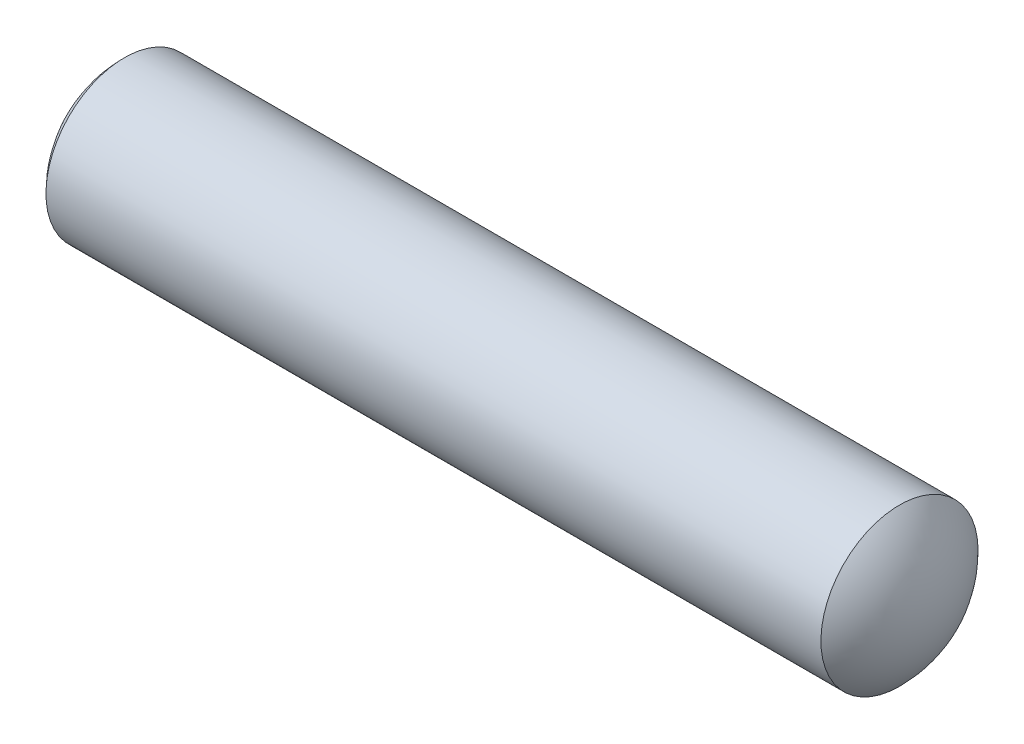
ISO-10303-21;
HEADER;
FILE_DESCRIPTION(('STEP AP214'),'2;1');
FILE_NAME('part.step','',(''),(''),'','','');
FILE_SCHEMA(('AUTOMOTIVE_DESIGN { 1 0 10303 214 1 1 1 1 }'));
ENDSEC;
DATA;
#1=APPLICATION_CONTEXT('core data for automotive mechanical design processes');
#2=APPLICATION_PROTOCOL_DEFINITION('international standard','automotive_design',2000,#1);
#3=PRODUCT_CONTEXT('',#1,'mechanical');
#4=PRODUCT('Part','Part','',(#3));
#5=PRODUCT_RELATED_PRODUCT_CATEGORY('part','',(#4));
#6=PRODUCT_DEFINITION_FORMATION('','',#4);
#7=PRODUCT_DEFINITION_CONTEXT('part definition',#1,'design');
#8=PRODUCT_DEFINITION('design','',#6,#7);
#9=PRODUCT_DEFINITION_SHAPE('','',#8);
#10=(LENGTH_UNIT() NAMED_UNIT(*) SI_UNIT(.MILLI.,.METRE.));
#11=(NAMED_UNIT(*) PLANE_ANGLE_UNIT() SI_UNIT($,.RADIAN.));
#12=(NAMED_UNIT(*) SI_UNIT($,.STERADIAN.) SOLID_ANGLE_UNIT());
#13=UNCERTAINTY_MEASURE_WITH_UNIT(LENGTH_MEASURE(1.E-05),#10,'distance_accuracy_value','');
#14=(GEOMETRIC_REPRESENTATION_CONTEXT(3) GLOBAL_UNCERTAINTY_ASSIGNED_CONTEXT((#13)) GLOBAL_UNIT_ASSIGNED_CONTEXT((#10,
#11,#12)) REPRESENTATION_CONTEXT('',''));
#15=CARTESIAN_POINT('',(0.,0.,0.));
#16=DIRECTION('',(0.,0.,1.));
#17=DIRECTION('',(1.,0.,0.));
#18=AXIS2_PLACEMENT_3D('',#15,#16,#17);
#19=CARTESIAN_POINT('',(15.1875,21.3125,0.));
#20=DIRECTION('',(0.,0.,1.));
#21=DIRECTION('',(1.,0.,0.));
#22=AXIS2_PLACEMENT_3D('',#19,#20,#21);
#23=SPHERICAL_SURFACE('',#22,1.8375);
#24=CARTESIAN_POINT('',(15.1875,21.3125,0.));
#25=DIRECTION('',(-1.,0.,0.));
#26=DIRECTION('',(0.,-1.,0.));
#27=AXIS2_PLACEMENT_3D('',#24,#25,#26);
#28=SPHERICAL_SURFACE('',#27,1.8375);
#29=CARTESIAN_POINT('',(16.4734821149612,21.3125,0.));
#30=DIRECTION('',(-1.,0.,0.));
#31=DIRECTION('',(0.,-1.,0.));
#32=AXIS2_PLACEMENT_3D('',#29,#30,#31);
#33=CIRCLE('',#32,1.3125);
#34=CARTESIAN_POINT('',(16.4734821149612,20.,0.));
#35=VERTEX_POINT('',#34);
#36=EDGE_CURVE('E11',#35,#35,#33,.T.);
#37=ORIENTED_EDGE('',*,*,#36,.F.);
#38=EDGE_LOOP('',(#37));
#39=FACE_BOUND('',#38,.T.);
#40=ADVANCED_FACE('F17',(#39),#28,.T.);
#41=CARTESIAN_POINT('',(10.,21.3125,0.));
#42=DIRECTION('',(-1.,0.,0.));
#43=DIRECTION('',(0.,-1.,0.));
#44=AXIS2_PLACEMENT_3D('',#41,#42,#43);
#45=CYLINDRICAL_SURFACE('',#44,1.3125);
#46=CARTESIAN_POINT('',(3.52651788503884,21.3125,0.));
#47=DIRECTION('',(-1.,0.,0.));
#48=DIRECTION('',(0.,-1.,0.));
#49=AXIS2_PLACEMENT_3D('',#46,#47,#48);
#50=CIRCLE('',#49,1.3125);
#51=CARTESIAN_POINT('',(3.52651788503884,20.,0.));
#52=VERTEX_POINT('',#51);
#53=EDGE_CURVE('E27',#52,#52,#50,.T.);
#54=ORIENTED_EDGE('',*,*,#53,.F.);
#55=EDGE_LOOP('',(#54));
#56=FACE_BOUND('',#55,.T.);
#57=ORIENTED_EDGE('',*,*,#36,.T.);
#58=EDGE_LOOP('',(#57));
#59=FACE_BOUND('',#58,.T.);
#60=ADVANCED_FACE('F51',(#56,#59),#45,.T.);
#61=CARTESIAN_POINT('',(4.8125,21.3125,0.));
#62=DIRECTION('',(0.,0.,1.));
#63=DIRECTION('',(-1.,0.,0.));
#64=AXIS2_PLACEMENT_3D('',#61,#62,#63);
#65=SPHERICAL_SURFACE('',#64,1.8375);
#66=CARTESIAN_POINT('',(4.8125,21.3125,0.));
#67=DIRECTION('',(-1.,0.,0.));
#68=DIRECTION('',(0.,-1.,0.));
#69=AXIS2_PLACEMENT_3D('',#66,#67,#68);
#70=SPHERICAL_SURFACE('',#69,1.8375);
#71=ORIENTED_EDGE('',*,*,#53,.T.);
#72=EDGE_LOOP('',(#71));
#73=FACE_BOUND('',#72,.T.);
#74=ADVANCED_FACE('F19',(#73),#70,.T.);
#75=CLOSED_SHELL('',(#40,#60,#74));
#76=MANIFOLD_SOLID_BREP('B1',#75);
#77=ADVANCED_BREP_SHAPE_REPRESENTATION('',(#18,#76),#14);
#78=SHAPE_DEFINITION_REPRESENTATION(#9,#77);
ENDSEC;
END-ISO-10303-21;
